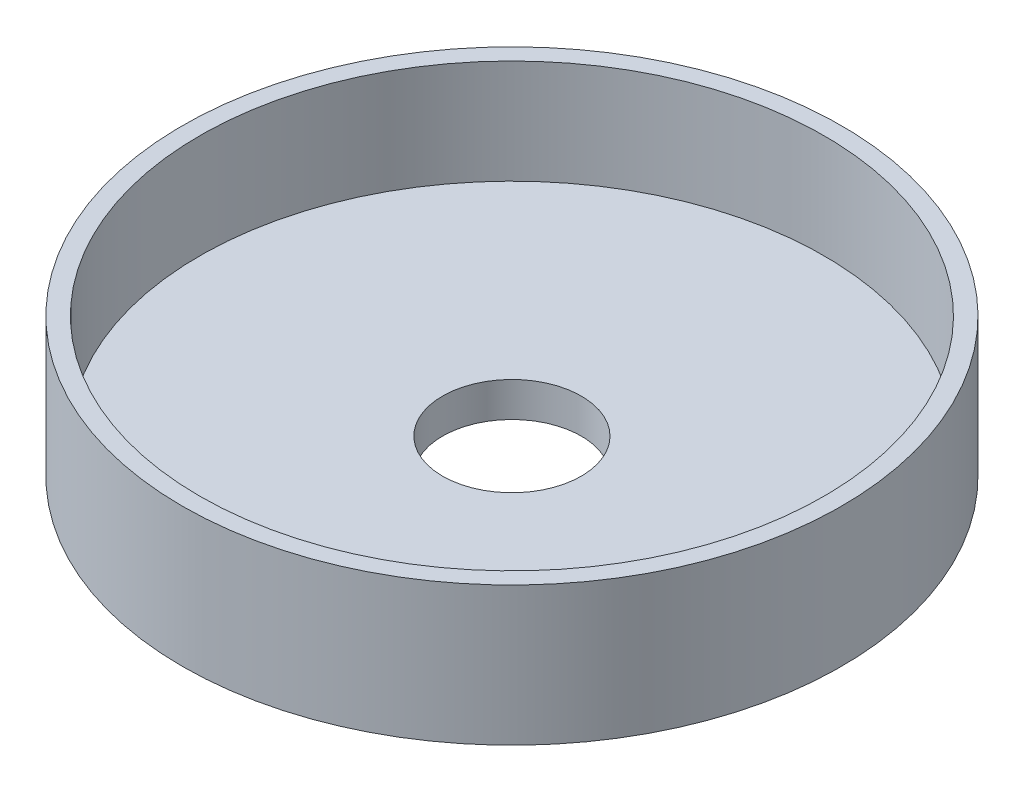
ISO-10303-21;
HEADER;
FILE_DESCRIPTION(('STEP AP214'),'2;1');
FILE_NAME('part.step','',(''),(''),'','','');
FILE_SCHEMA(('AUTOMOTIVE_DESIGN { 1 0 10303 214 1 1 1 1 }'));
ENDSEC;
DATA;
#1=APPLICATION_CONTEXT('core data for automotive mechanical design processes');
#2=APPLICATION_PROTOCOL_DEFINITION('international standard','automotive_design',2000,#1);
#3=PRODUCT_CONTEXT('',#1,'mechanical');
#4=PRODUCT('Part','Part','',(#3));
#5=PRODUCT_RELATED_PRODUCT_CATEGORY('part','',(#4));
#6=PRODUCT_DEFINITION_FORMATION('','',#4);
#7=PRODUCT_DEFINITION_CONTEXT('part definition',#1,'design');
#8=PRODUCT_DEFINITION('design','',#6,#7);
#9=PRODUCT_DEFINITION_SHAPE('','',#8);
#10=(LENGTH_UNIT() NAMED_UNIT(*) SI_UNIT(.MILLI.,.METRE.));
#11=(NAMED_UNIT(*) PLANE_ANGLE_UNIT() SI_UNIT($,.RADIAN.));
#12=(NAMED_UNIT(*) SI_UNIT($,.STERADIAN.) SOLID_ANGLE_UNIT());
#13=UNCERTAINTY_MEASURE_WITH_UNIT(LENGTH_MEASURE(1.E-05),#10,'distance_accuracy_value','');
#14=(GEOMETRIC_REPRESENTATION_CONTEXT(3) GLOBAL_UNCERTAINTY_ASSIGNED_CONTEXT((#13)) GLOBAL_UNIT_ASSIGNED_CONTEXT((#10,
#11,#12)) REPRESENTATION_CONTEXT('',''));
#15=CARTESIAN_POINT('',(0.,0.,0.));
#16=DIRECTION('',(0.,0.,1.));
#17=DIRECTION('',(1.,0.,0.));
#18=AXIS2_PLACEMENT_3D('',#15,#16,#17);
#19=CARTESIAN_POINT('',(0.,10.,0.));
#20=DIRECTION('',(0.,-1.,0.));
#21=DIRECTION('',(0.,0.,-1.));
#22=AXIS2_PLACEMENT_3D('',#19,#20,#21);
#23=CYLINDRICAL_SURFACE('',#22,23.75);
#24=CARTESIAN_POINT('',(0.,10.,0.));
#25=DIRECTION('',(0.,1.,0.));
#26=DIRECTION('',(0.,0.,1.));
#27=AXIS2_PLACEMENT_3D('',#24,#25,#26);
#28=CIRCLE('',#27,23.75);
#29=CARTESIAN_POINT('',(0.,10.,23.75));
#30=VERTEX_POINT('',#29);
#31=EDGE_CURVE('E10',#30,#30,#28,.T.);
#32=ORIENTED_EDGE('',*,*,#31,.F.);
#33=EDGE_LOOP('',(#32));
#34=FACE_BOUND('',#33,.T.);
#35=CARTESIAN_POINT('',(0.,0.,0.));
#36=DIRECTION('',(0.,1.,0.));
#37=DIRECTION('',(0.,0.,1.));
#38=AXIS2_PLACEMENT_3D('',#35,#36,#37);
#39=CIRCLE('',#38,23.75);
#40=CARTESIAN_POINT('',(0.,0.,23.75));
#41=VERTEX_POINT('',#40);
#42=EDGE_CURVE('E40',#41,#41,#39,.T.);
#43=ORIENTED_EDGE('',*,*,#42,.T.);
#44=EDGE_LOOP('',(#43));
#45=FACE_BOUND('',#44,.T.);
#46=ADVANCED_FACE('F33',(#34,#45),#23,.T.);
#47=CARTESIAN_POINT('',(0.,10.,0.));
#48=DIRECTION('',(0.,1.,0.));
#49=DIRECTION('',(0.,0.,1.));
#50=AXIS2_PLACEMENT_3D('',#47,#48,#49);
#51=PLANE('',#50);
#52=CARTESIAN_POINT('',(0.,10.,0.));
#53=DIRECTION('',(0.,1.,0.));
#54=DIRECTION('',(0.,0.,1.));
#55=AXIS2_PLACEMENT_3D('',#52,#53,#54);
#56=CIRCLE('',#55,22.5);
#57=CARTESIAN_POINT('',(0.,10.,22.5));
#58=VERTEX_POINT('',#57);
#59=EDGE_CURVE('E47',#58,#58,#56,.T.);
#60=ORIENTED_EDGE('',*,*,#59,.F.);
#61=EDGE_LOOP('',(#60));
#62=FACE_BOUND('',#61,.T.);
#63=ORIENTED_EDGE('',*,*,#31,.T.);
#64=EDGE_LOOP('',(#63));
#65=FACE_BOUND('',#64,.T.);
#66=ADVANCED_FACE('F73',(#62,#65),#51,.T.);
#67=CARTESIAN_POINT('',(0.,0.,0.));
#68=DIRECTION('',(0.,1.,0.));
#69=DIRECTION('',(0.,0.,1.));
#70=AXIS2_PLACEMENT_3D('',#67,#68,#69);
#71=PLANE('',#70);
#72=CARTESIAN_POINT('',(0.,0.,0.));
#73=DIRECTION('',(0.,1.,0.));
#74=DIRECTION('',(0.,0.,1.));
#75=AXIS2_PLACEMENT_3D('',#72,#73,#74);
#76=CIRCLE('',#75,5.);
#77=CARTESIAN_POINT('',(0.,0.,5.));
#78=VERTEX_POINT('',#77);
#79=EDGE_CURVE('E36',#78,#78,#76,.T.);
#80=ORIENTED_EDGE('',*,*,#79,.T.);
#81=EDGE_LOOP('',(#80));
#82=FACE_BOUND('',#81,.T.);
#83=ORIENTED_EDGE('',*,*,#42,.F.);
#84=EDGE_LOOP('',(#83));
#85=FACE_BOUND('',#84,.T.);
#86=ADVANCED_FACE('F59',(#82,#85),#71,.F.);
#87=CARTESIAN_POINT('',(0.,2.5,0.));
#88=DIRECTION('',(0.,1.,0.));
#89=DIRECTION('',(0.,0.,1.));
#90=AXIS2_PLACEMENT_3D('',#87,#88,#89);
#91=CYLINDRICAL_SURFACE('',#90,22.5);
#92=CARTESIAN_POINT('',(0.,2.5,0.));
#93=DIRECTION('',(0.,1.,0.));
#94=DIRECTION('',(0.,0.,1.));
#95=AXIS2_PLACEMENT_3D('',#92,#93,#94);
#96=CIRCLE('',#95,22.5);
#97=CARTESIAN_POINT('',(0.,2.5,22.5));
#98=VERTEX_POINT('',#97);
#99=EDGE_CURVE('E45',#98,#98,#96,.T.);
#100=ORIENTED_EDGE('',*,*,#99,.F.);
#101=EDGE_LOOP('',(#100));
#102=FACE_BOUND('',#101,.T.);
#103=ORIENTED_EDGE('',*,*,#59,.T.);
#104=EDGE_LOOP('',(#103));
#105=FACE_BOUND('',#104,.T.);
#106=ADVANCED_FACE('F69',(#102,#105),#91,.F.);
#107=CARTESIAN_POINT('',(0.,2.5,0.));
#108=DIRECTION('',(0.,1.,0.));
#109=DIRECTION('',(0.,0.,1.));
#110=AXIS2_PLACEMENT_3D('',#107,#108,#109);
#111=PLANE('',#110);
#112=CARTESIAN_POINT('',(0.,2.5,0.));
#113=DIRECTION('',(0.,1.,0.));
#114=DIRECTION('',(0.,0.,1.));
#115=AXIS2_PLACEMENT_3D('',#112,#113,#114);
#116=CIRCLE('',#115,5.);
#117=CARTESIAN_POINT('',(0.,2.5,5.));
#118=VERTEX_POINT('',#117);
#119=EDGE_CURVE('E52',#118,#118,#116,.T.);
#120=ORIENTED_EDGE('',*,*,#119,.F.);
#121=EDGE_LOOP('',(#120));
#122=FACE_BOUND('',#121,.T.);
#123=ORIENTED_EDGE('',*,*,#99,.T.);
#124=EDGE_LOOP('',(#123));
#125=FACE_BOUND('',#124,.T.);
#126=ADVANCED_FACE('F64',(#122,#125),#111,.T.);
#127=CARTESIAN_POINT('',(0.,-5.,0.));
#128=DIRECTION('',(0.,1.,0.));
#129=DIRECTION('',(0.,0.,1.));
#130=AXIS2_PLACEMENT_3D('',#127,#128,#129);
#131=CYLINDRICAL_SURFACE('',#130,5.);
#132=ORIENTED_EDGE('',*,*,#119,.T.);
#133=EDGE_LOOP('',(#132));
#134=FACE_BOUND('',#133,.T.);
#135=ORIENTED_EDGE('',*,*,#79,.F.);
#136=EDGE_LOOP('',(#135));
#137=FACE_BOUND('',#136,.T.);
#138=ADVANCED_FACE('F62',(#134,#137),#131,.F.);
#139=CLOSED_SHELL('',(#46,#66,#86,#106,#126,#138));
#140=MANIFOLD_SOLID_BREP('B2',#139);
#141=ADVANCED_BREP_SHAPE_REPRESENTATION('',(#18,#140),#14);
#142=SHAPE_DEFINITION_REPRESENTATION(#9,#141);
ENDSEC;
END-ISO-10303-21;
